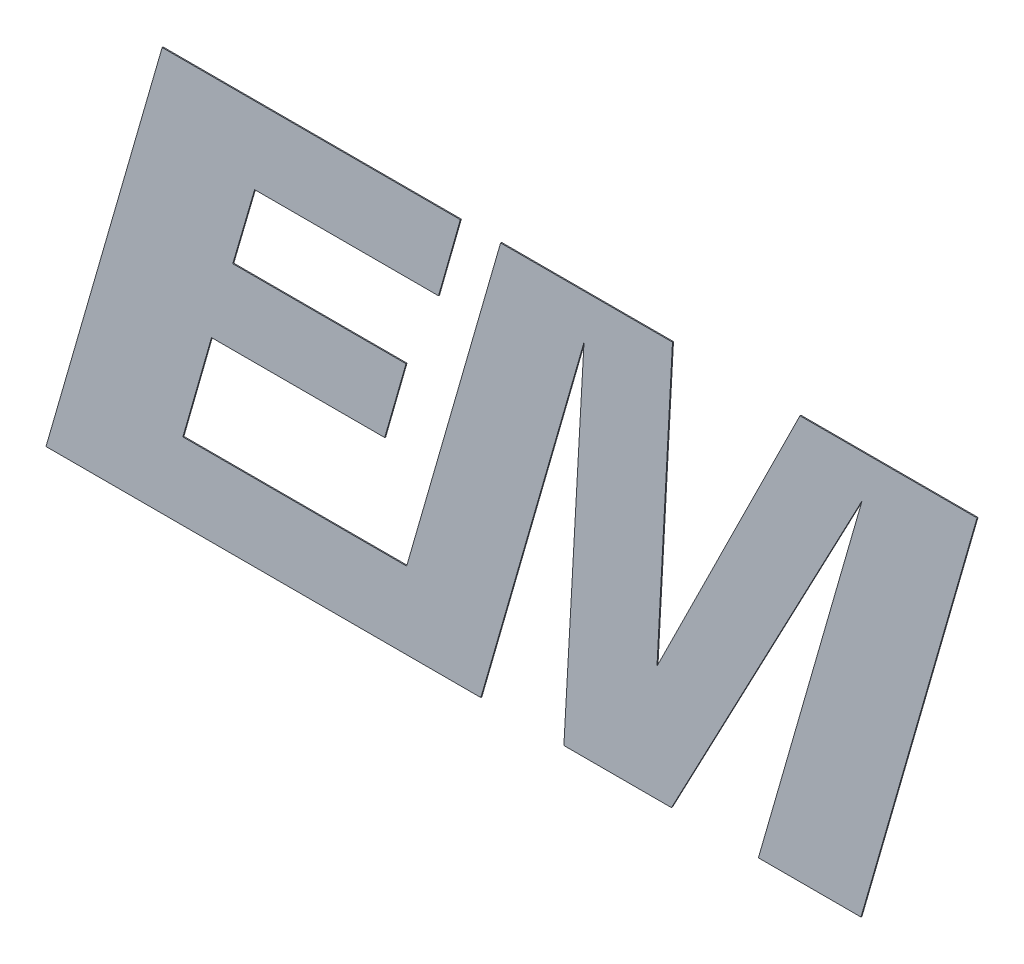
ISO-10303-21;
HEADER;
FILE_DESCRIPTION(('STEP AP214'),'2;1');
FILE_NAME('part.step','',(''),(''),'','','');
FILE_SCHEMA(('AUTOMOTIVE_DESIGN { 1 0 10303 214 1 1 1 1 }'));
ENDSEC;
DATA;
#1=APPLICATION_CONTEXT('core data for automotive mechanical design processes');
#2=APPLICATION_PROTOCOL_DEFINITION('international standard','automotive_design',2000,#1);
#3=PRODUCT_CONTEXT('',#1,'mechanical');
#4=PRODUCT('Part','Part','',(#3));
#5=PRODUCT_RELATED_PRODUCT_CATEGORY('part','',(#4));
#6=PRODUCT_DEFINITION_FORMATION('','',#4);
#7=PRODUCT_DEFINITION_CONTEXT('part definition',#1,'design');
#8=PRODUCT_DEFINITION('design','',#6,#7);
#9=PRODUCT_DEFINITION_SHAPE('','',#8);
#10=(LENGTH_UNIT() NAMED_UNIT(*) SI_UNIT(.MILLI.,.METRE.));
#11=(NAMED_UNIT(*) PLANE_ANGLE_UNIT() SI_UNIT($,.RADIAN.));
#12=(NAMED_UNIT(*) SI_UNIT($,.STERADIAN.) SOLID_ANGLE_UNIT());
#13=UNCERTAINTY_MEASURE_WITH_UNIT(LENGTH_MEASURE(1.E-05),#10,'distance_accuracy_value','');
#14=(GEOMETRIC_REPRESENTATION_CONTEXT(3) GLOBAL_UNCERTAINTY_ASSIGNED_CONTEXT((#13)) GLOBAL_UNIT_ASSIGNED_CONTEXT((#10,
#11,#12)) REPRESENTATION_CONTEXT('',''));
#15=CARTESIAN_POINT('',(0.,0.,0.));
#16=DIRECTION('',(0.,0.,1.));
#17=DIRECTION('',(1.,0.,0.));
#18=AXIS2_PLACEMENT_3D('',#15,#16,#17);
#19=CARTESIAN_POINT('',(10.8469375416372,6.82608440985244,5.205));
#20=DIRECTION('',(0.,-1.,0.));
#21=DIRECTION('',(0.,0.,-1.));
#22=AXIS2_PLACEMENT_3D('',#19,#20,#21);
#23=PLANE('',#22);
#24=DIRECTION('',(-1.,0.,0.));
#25=VECTOR('',#24,1.);
#26=CARTESIAN_POINT('',(10.8469375416372,6.82608440985244,5.2));
#27=LINE('',#26,#25);
#28=CARTESIAN_POINT('',(10.8469375416372,6.82608440985244,5.2));
#29=VERTEX_POINT('',#28);
#30=CARTESIAN_POINT('',(9.94792919842269,6.82608440985244,5.2));
#31=VERTEX_POINT('',#30);
#32=EDGE_CURVE('E11',#29,#31,#27,.T.);
#33=ORIENTED_EDGE('',*,*,#32,.T.);
#34=DIRECTION('',(0.,0.,-1.));
#35=VECTOR('',#34,1.);
#36=CARTESIAN_POINT('',(9.94792919842269,6.82608440985244,5.205));
#37=LINE('',#36,#35);
#38=CARTESIAN_POINT('',(9.94792919842269,6.82608440985244,5.205));
#39=VERTEX_POINT('',#38);
#40=EDGE_CURVE('E43',#39,#31,#37,.T.);
#41=ORIENTED_EDGE('',*,*,#40,.F.);
#42=DIRECTION('',(-1.,0.,0.));
#43=VECTOR('',#42,1.);
#44=CARTESIAN_POINT('',(10.8469375416372,6.82608440985244,5.205));
#45=LINE('',#44,#43);
#46=CARTESIAN_POINT('',(10.8469375416372,6.82608440985244,5.205));
#47=VERTEX_POINT('',#46);
#48=EDGE_CURVE('E415',#47,#39,#45,.T.);
#49=ORIENTED_EDGE('',*,*,#48,.F.);
#50=DIRECTION('',(0.,0.,-1.));
#51=VECTOR('',#50,1.);
#52=CARTESIAN_POINT('',(10.8469375416372,6.82608440985244,5.205));
#53=LINE('',#52,#51);
#54=EDGE_CURVE('E28',#47,#29,#53,.T.);
#55=ORIENTED_EDGE('',*,*,#54,.T.);
#56=EDGE_LOOP('',(#33,#41,#49,#55));
#57=FACE_BOUND('',#56,.T.);
#58=ADVANCED_FACE('F17',(#57),#23,.F.);
#59=CARTESIAN_POINT('',(9.94792919842269,6.82608440985244,5.205));
#60=DIRECTION('',(0.89586763618268,-0.444321030832952,0.));
#61=DIRECTION('',(0.,0.,-1.));
#62=AXIS2_PLACEMENT_3D('',#59,#60,#61);
#63=PLANE('',#62);
#64=DIRECTION('',(-0.444321030832952,-0.89586763618268,0.));
#65=VECTOR('',#64,1.);
#66=CARTESIAN_POINT('',(9.94792919842269,6.82608440985244,5.2));
#67=LINE('',#66,#65);
#68=CARTESIAN_POINT('',(9.22164915934347,5.36171352334091,5.2));
#69=VERTEX_POINT('',#68);
#70=EDGE_CURVE('E303',#31,#69,#67,.T.);
#71=ORIENTED_EDGE('',*,*,#70,.T.);
#72=DIRECTION('',(0.,0.,-1.));
#73=VECTOR('',#72,1.);
#74=CARTESIAN_POINT('',(9.22164915934347,5.36171352334091,5.205));
#75=LINE('',#74,#73);
#76=CARTESIAN_POINT('',(9.22164915934347,5.36171352334091,5.205));
#77=VERTEX_POINT('',#76);
#78=EDGE_CURVE('E365',#77,#69,#75,.T.);
#79=ORIENTED_EDGE('',*,*,#78,.F.);
#80=DIRECTION('',(-0.444321030832952,-0.89586763618268,0.));
#81=VECTOR('',#80,1.);
#82=CARTESIAN_POINT('',(9.94792919842269,6.82608440985244,5.205));
#83=LINE('',#82,#81);
#84=EDGE_CURVE('E372',#39,#77,#83,.T.);
#85=ORIENTED_EDGE('',*,*,#84,.F.);
#86=ORIENTED_EDGE('',*,*,#40,.T.);
#87=EDGE_LOOP('',(#71,#79,#85,#86));
#88=FACE_BOUND('',#87,.T.);
#89=ADVANCED_FACE('F510',(#88),#63,.F.);
#90=CARTESIAN_POINT('',(9.22164915934347,5.36171352334091,5.205));
#91=DIRECTION('',(-0.998554284376095,0.0537525920690858,0.));
#92=DIRECTION('',(0.,0.,1.));
#93=AXIS2_PLACEMENT_3D('',#90,#91,#92);
#94=PLANE('',#93);
#95=DIRECTION('',(0.0537525920690858,0.998554284376095,0.));
#96=VECTOR('',#95,1.);
#97=CARTESIAN_POINT('',(9.22164915934347,5.36171352334091,5.2));
#98=LINE('',#97,#96);
#99=CARTESIAN_POINT('',(9.30047685267181,6.82608440985244,5.2));
#100=VERTEX_POINT('',#99);
#101=EDGE_CURVE('E347',#69,#100,#98,.T.);
#102=ORIENTED_EDGE('',*,*,#101,.T.);
#103=DIRECTION('',(0.,0.,-1.));
#104=VECTOR('',#103,1.);
#105=CARTESIAN_POINT('',(9.30047685267181,6.82608440985244,5.205));
#106=LINE('',#105,#104);
#107=CARTESIAN_POINT('',(9.30047685267181,6.82608440985244,5.205));
#108=VERTEX_POINT('',#107);
#109=EDGE_CURVE('E153',#108,#100,#106,.T.);
#110=ORIENTED_EDGE('',*,*,#109,.F.);
#111=DIRECTION('',(0.0537525920690858,0.998554284376095,0.));
#112=VECTOR('',#111,1.);
#113=CARTESIAN_POINT('',(9.22164915934347,5.36171352334091,5.205));
#114=LINE('',#113,#112);
#115=EDGE_CURVE('E164',#77,#108,#114,.T.);
#116=ORIENTED_EDGE('',*,*,#115,.F.);
#117=ORIENTED_EDGE('',*,*,#78,.T.);
#118=EDGE_LOOP('',(#102,#110,#116,#117));
#119=FACE_BOUND('',#118,.T.);
#120=ADVANCED_FACE('F513',(#119),#94,.F.);
#121=CARTESIAN_POINT('',(9.30047685267181,6.82608440985244,5.205));
#122=DIRECTION('',(0.,-1.,0.));
#123=DIRECTION('',(0.,0.,-1.));
#124=AXIS2_PLACEMENT_3D('',#121,#122,#123);
#125=PLANE('',#124);
#126=DIRECTION('',(-1.,0.,0.));
#127=VECTOR('',#126,1.);
#128=CARTESIAN_POINT('',(9.30047685267181,6.82608440985244,5.2));
#129=LINE('',#128,#127);
#130=CARTESIAN_POINT('',(8.42755896722305,6.82608440985244,5.2));
#131=VERTEX_POINT('',#130);
#132=EDGE_CURVE('E398',#100,#131,#129,.T.);
#133=ORIENTED_EDGE('',*,*,#132,.T.);
#134=DIRECTION('',(0.,0.,-1.));
#135=VECTOR('',#134,1.);
#136=CARTESIAN_POINT('',(8.42755896722305,6.82608440985244,5.205));
#137=LINE('',#136,#135);
#138=CARTESIAN_POINT('',(8.42755896722305,6.82608440985244,5.205));
#139=VERTEX_POINT('',#138);
#140=EDGE_CURVE('E271',#139,#131,#137,.T.);
#141=ORIENTED_EDGE('',*,*,#140,.F.);
#142=DIRECTION('',(-1.,0.,0.));
#143=VECTOR('',#142,1.);
#144=CARTESIAN_POINT('',(9.30047685267181,6.82608440985244,5.205));
#145=LINE('',#144,#143);
#146=EDGE_CURVE('E286',#108,#139,#145,.T.);
#147=ORIENTED_EDGE('',*,*,#146,.F.);
#148=ORIENTED_EDGE('',*,*,#109,.T.);
#149=EDGE_LOOP('',(#133,#141,#147,#148));
#150=FACE_BOUND('',#149,.T.);
#151=ADVANCED_FACE('F518',(#150),#125,.F.);
#152=CARTESIAN_POINT('',(8.42755896722305,6.82608440985244,5.205));
#153=DIRECTION('',(0.961085306551383,-0.276251757516641,0.));
#154=DIRECTION('',(0.,0.,-1.));
#155=AXIS2_PLACEMENT_3D('',#152,#153,#154);
#156=PLANE('',#155);
#157=DIRECTION('',(-0.276251757516641,-0.961085306551383,0.));
#158=VECTOR('',#157,1.);
#159=CARTESIAN_POINT('',(8.42755896722305,6.82608440985244,5.2));
#160=LINE('',#159,#158);
#161=CARTESIAN_POINT('',(7.95047417520321,5.16629701985992,5.2));
#162=VERTEX_POINT('',#161);
#163=EDGE_CURVE('E348',#131,#162,#160,.T.);
#164=ORIENTED_EDGE('',*,*,#163,.T.);
#165=DIRECTION('',(0.,0.,-1.));
#166=VECTOR('',#165,1.);
#167=CARTESIAN_POINT('',(7.95047417520321,5.16629701985992,5.205));
#168=LINE('',#167,#166);
#169=CARTESIAN_POINT('',(7.95047417520321,5.16629701985992,5.205));
#170=VERTEX_POINT('',#169);
#171=EDGE_CURVE('E266',#170,#162,#168,.T.);
#172=ORIENTED_EDGE('',*,*,#171,.F.);
#173=DIRECTION('',(-0.276251757516641,-0.961085306551383,0.));
#174=VECTOR('',#173,1.);
#175=CARTESIAN_POINT('',(8.42755896722305,6.82608440985244,5.205));
#176=LINE('',#175,#174);
#177=EDGE_CURVE('E373',#139,#170,#176,.T.);
#178=ORIENTED_EDGE('',*,*,#177,.F.);
#179=ORIENTED_EDGE('',*,*,#140,.T.);
#180=EDGE_LOOP('',(#164,#172,#178,#179));
#181=FACE_BOUND('',#180,.T.);
#182=ADVANCED_FACE('F555',(#181),#156,.F.);
#183=CARTESIAN_POINT('',(7.95047417520321,5.16629701985992,5.205));
#184=DIRECTION('',(0.,-1.,0.));
#185=DIRECTION('',(0.,0.,-1.));
#186=AXIS2_PLACEMENT_3D('',#183,#184,#185);
#187=PLANE('',#186);
#188=DIRECTION('',(-1.,0.,0.));
#189=VECTOR('',#188,1.);
#190=CARTESIAN_POINT('',(7.95047417520321,5.16629701985992,5.2));
#191=LINE('',#190,#189);
#192=CARTESIAN_POINT('',(6.8142036420702,5.16629701985992,5.2));
#193=VERTEX_POINT('',#192);
#194=EDGE_CURVE('E263',#162,#193,#191,.T.);
#195=ORIENTED_EDGE('',*,*,#194,.T.);
#196=DIRECTION('',(0.,0.,-1.));
#197=VECTOR('',#196,1.);
#198=CARTESIAN_POINT('',(6.8142036420702,5.16629701985992,5.205));
#199=LINE('',#198,#197);
#200=CARTESIAN_POINT('',(6.8142036420702,5.16629701985992,5.205));
#201=VERTEX_POINT('',#200);
#202=EDGE_CURVE('E249',#201,#193,#199,.T.);
#203=ORIENTED_EDGE('',*,*,#202,.F.);
#204=DIRECTION('',(-1.,0.,0.));
#205=VECTOR('',#204,1.);
#206=CARTESIAN_POINT('',(7.95047417520321,5.16629701985992,5.205));
#207=LINE('',#206,#205);
#208=EDGE_CURVE('E340',#170,#201,#207,.T.);
#209=ORIENTED_EDGE('',*,*,#208,.F.);
#210=ORIENTED_EDGE('',*,*,#171,.T.);
#211=EDGE_LOOP('',(#195,#203,#209,#210));
#212=FACE_BOUND('',#211,.T.);
#213=ADVANCED_FACE('F264',(#212),#187,.F.);
#214=CARTESIAN_POINT('',(6.8142036420702,5.16629701985992,5.205));
#215=DIRECTION('',(-0.96172348726206,0.274021776595407,0.));
#216=DIRECTION('',(0.,0.,1.));
#217=AXIS2_PLACEMENT_3D('',#214,#215,#216);
#218=PLANE('',#217);
#219=DIRECTION('',(0.274021776595406,0.96172348726206,0.));
#220=VECTOR('',#219,1.);
#221=CARTESIAN_POINT('',(6.8142036420702,5.16629701985992,5.2));
#222=LINE('',#221,#220);
#223=CARTESIAN_POINT('',(6.9593583790476,5.6757409099513,5.2));
#224=VERTEX_POINT('',#223);
#225=EDGE_CURVE('E254',#193,#224,#222,.T.);
#226=ORIENTED_EDGE('',*,*,#225,.T.);
#227=DIRECTION('',(0.,0.,-1.));
#228=VECTOR('',#227,1.);
#229=CARTESIAN_POINT('',(6.9593583790476,5.6757409099513,5.205));
#230=LINE('',#229,#228);
#231=CARTESIAN_POINT('',(6.9593583790476,5.6757409099513,5.205));
#232=VERTEX_POINT('',#231);
#233=EDGE_CURVE('E351',#232,#224,#230,.T.);
#234=ORIENTED_EDGE('',*,*,#233,.F.);
#235=DIRECTION('',(0.274021776595406,0.96172348726206,0.));
#236=VECTOR('',#235,1.);
#237=CARTESIAN_POINT('',(6.8142036420702,5.16629701985992,5.205));
#238=LINE('',#237,#236);
#239=EDGE_CURVE('E256',#201,#232,#238,.T.);
#240=ORIENTED_EDGE('',*,*,#239,.F.);
#241=ORIENTED_EDGE('',*,*,#202,.T.);
#242=EDGE_LOOP('',(#226,#234,#240,#241));
#243=FACE_BOUND('',#242,.T.);
#244=ADVANCED_FACE('F251',(#243),#218,.F.);
#245=CARTESIAN_POINT('',(6.9593583790476,5.6757409099513,5.205));
#246=DIRECTION('',(0.,1.,0.));
#247=DIRECTION('',(1.,0.,0.));
#248=AXIS2_PLACEMENT_3D('',#245,#246,#247);
#249=PLANE('',#248);
#250=DIRECTION('',(1.,0.,0.));
#251=VECTOR('',#250,1.);
#252=CARTESIAN_POINT('',(6.9593583790476,5.6757409099513,5.2));
#253=LINE('',#252,#251);
#254=CARTESIAN_POINT('',(7.83901228958873,5.6757409099513,5.2));
#255=VERTEX_POINT('',#254);
#256=EDGE_CURVE('E260',#224,#255,#253,.T.);
#257=ORIENTED_EDGE('',*,*,#256,.T.);
#258=DIRECTION('',(0.,0.,-1.));
#259=VECTOR('',#258,1.);
#260=CARTESIAN_POINT('',(7.83901228958873,5.6757409099513,5.205));
#261=LINE('',#260,#259);
#262=CARTESIAN_POINT('',(7.83901228958873,5.6757409099513,5.205));
#263=VERTEX_POINT('',#262);
#264=EDGE_CURVE('E387',#263,#255,#261,.T.);
#265=ORIENTED_EDGE('',*,*,#264,.F.);
#266=DIRECTION('',(1.,0.,0.));
#267=VECTOR('',#266,1.);
#268=CARTESIAN_POINT('',(6.9593583790476,5.6757409099513,5.205));
#269=LINE('',#268,#267);
#270=EDGE_CURVE('E341',#232,#263,#269,.T.);
#271=ORIENTED_EDGE('',*,*,#270,.F.);
#272=ORIENTED_EDGE('',*,*,#233,.T.);
#273=EDGE_LOOP('',(#257,#265,#271,#272));
#274=FACE_BOUND('',#273,.T.);
#275=ADVANCED_FACE('F630',(#274),#249,.F.);
#276=CARTESIAN_POINT('',(7.83901228958873,5.6757409099513,5.205));
#277=DIRECTION('',(-0.961545429433448,0.27464593049169,0.));
#278=DIRECTION('',(0.,0.,1.));
#279=AXIS2_PLACEMENT_3D('',#276,#277,#278);
#280=PLANE('',#279);
#281=DIRECTION('',(0.27464593049169,0.961545429433448,0.));
#282=VECTOR('',#281,1.);
#283=CARTESIAN_POINT('',(7.83901228958873,5.6757409099513,5.2));
#284=LINE('',#283,#282);
#285=CARTESIAN_POINT('',(7.94724574439114,6.05467018660481,5.2));
#286=VERTEX_POINT('',#285);
#287=EDGE_CURVE('E354',#255,#286,#284,.T.);
#288=ORIENTED_EDGE('',*,*,#287,.T.);
#289=DIRECTION('',(0.,0.,-1.));
#290=VECTOR('',#289,1.);
#291=CARTESIAN_POINT('',(7.94724574439114,6.05467018660481,5.205));
#292=LINE('',#291,#290);
#293=CARTESIAN_POINT('',(7.94724574439114,6.05467018660481,5.205));
#294=VERTEX_POINT('',#293);
#295=EDGE_CURVE('E293',#294,#286,#292,.T.);
#296=ORIENTED_EDGE('',*,*,#295,.F.);
#297=DIRECTION('',(0.27464593049169,0.961545429433448,0.));
#298=VECTOR('',#297,1.);
#299=CARTESIAN_POINT('',(7.83901228958873,5.6757409099513,5.205));
#300=LINE('',#299,#298);
#301=EDGE_CURVE('E357',#263,#294,#300,.T.);
#302=ORIENTED_EDGE('',*,*,#301,.F.);
#303=ORIENTED_EDGE('',*,*,#264,.T.);
#304=EDGE_LOOP('',(#288,#296,#302,#303));
#305=FACE_BOUND('',#304,.T.);
#306=ADVANCED_FACE('F621',(#305),#280,.F.);
#307=CARTESIAN_POINT('',(7.94724574439114,6.05467018660481,5.205));
#308=DIRECTION('',(0.,-1.,0.));
#309=DIRECTION('',(0.,0.,-1.));
#310=AXIS2_PLACEMENT_3D('',#307,#308,#309);
#311=PLANE('',#310);
#312=DIRECTION('',(-1.,0.,0.));
#313=VECTOR('',#312,1.);
#314=CARTESIAN_POINT('',(7.94724574439114,6.05467018660481,5.2));
#315=LINE('',#314,#313);
#316=CARTESIAN_POINT('',(7.06746718401157,6.05467018660481,5.2));
#317=VERTEX_POINT('',#316);
#318=EDGE_CURVE('E296',#286,#317,#315,.T.);
#319=ORIENTED_EDGE('',*,*,#318,.T.);
#320=DIRECTION('',(0.,0.,-1.));
#321=VECTOR('',#320,1.);
#322=CARTESIAN_POINT('',(7.06746718401157,6.05467018660481,5.205));
#323=LINE('',#322,#321);
#324=CARTESIAN_POINT('',(7.06746718401157,6.05467018660481,5.205));
#325=VERTEX_POINT('',#324);
#326=EDGE_CURVE('E383',#325,#317,#323,.T.);
#327=ORIENTED_EDGE('',*,*,#326,.F.);
#328=DIRECTION('',(-1.,0.,0.));
#329=VECTOR('',#328,1.);
#330=CARTESIAN_POINT('',(7.94724574439114,6.05467018660481,5.205));
#331=LINE('',#330,#329);
#332=EDGE_CURVE('E360',#294,#325,#331,.T.);
#333=ORIENTED_EDGE('',*,*,#332,.F.);
#334=ORIENTED_EDGE('',*,*,#295,.T.);
#335=EDGE_LOOP('',(#319,#327,#333,#334));
#336=FACE_BOUND('',#335,.T.);
#337=ADVANCED_FACE('F591',(#336),#311,.F.);
#338=CARTESIAN_POINT('',(7.06746718401157,6.05467018660481,5.205));
#339=DIRECTION('',(-0.960176311432759,0.27939479408783,0.));
#340=DIRECTION('',(0.,0.,1.));
#341=AXIS2_PLACEMENT_3D('',#338,#339,#340);
#342=PLANE('',#341);
#343=DIRECTION('',(0.27939479408783,0.960176311432759,0.));
#344=VECTOR('',#343,1.);
#345=CARTESIAN_POINT('',(7.06746718401157,6.05467018660481,5.2));
#346=LINE('',#345,#344);
#347=CARTESIAN_POINT('',(7.17840554031016,6.43592418274659,5.2));
#348=VERTEX_POINT('',#347);
#349=EDGE_CURVE('E297',#317,#348,#346,.T.);
#350=ORIENTED_EDGE('',*,*,#349,.T.);
#351=DIRECTION('',(0.,0.,-1.));
#352=VECTOR('',#351,1.);
#353=CARTESIAN_POINT('',(7.17840554031016,6.43592418274659,5.205));
#354=LINE('',#353,#352);
#355=CARTESIAN_POINT('',(7.17840554031016,6.43592418274659,5.205));
#356=VERTEX_POINT('',#355);
#357=EDGE_CURVE('E298',#356,#348,#354,.T.);
#358=ORIENTED_EDGE('',*,*,#357,.F.);
#359=DIRECTION('',(0.27939479408783,0.960176311432759,0.));
#360=VECTOR('',#359,1.);
#361=CARTESIAN_POINT('',(7.06746718401157,6.05467018660481,5.205));
#362=LINE('',#361,#360);
#363=EDGE_CURVE('E394',#325,#356,#362,.T.);
#364=ORIENTED_EDGE('',*,*,#363,.F.);
#365=ORIENTED_EDGE('',*,*,#326,.T.);
#366=EDGE_LOOP('',(#350,#358,#364,#365));
#367=FACE_BOUND('',#366,.T.);
#368=ADVANCED_FACE('F587',(#367),#342,.F.);
#369=CARTESIAN_POINT('',(7.17840554031016,6.43592418274659,5.205));
#370=DIRECTION('',(0.,1.,0.));
#371=DIRECTION('',(1.,0.,0.));
#372=AXIS2_PLACEMENT_3D('',#369,#370,#371);
#373=PLANE('',#372);
#374=DIRECTION('',(1.,0.,0.));
#375=VECTOR('',#374,1.);
#376=CARTESIAN_POINT('',(7.17840554031016,6.43592418274659,5.2));
#377=LINE('',#376,#375);
#378=CARTESIAN_POINT('',(8.11229459559777,6.43592418274659,5.2));
#379=VERTEX_POINT('',#378);
#380=EDGE_CURVE('E301',#348,#379,#377,.T.);
#381=ORIENTED_EDGE('',*,*,#380,.T.);
#382=DIRECTION('',(0.,0.,-1.));
#383=VECTOR('',#382,1.);
#384=CARTESIAN_POINT('',(8.11229459559777,6.43592418274659,5.205));
#385=LINE('',#384,#383);
#386=CARTESIAN_POINT('',(8.11229459559777,6.43592418274659,5.205));
#387=VERTEX_POINT('',#386);
#388=EDGE_CURVE('E379',#387,#379,#385,.T.);
#389=ORIENTED_EDGE('',*,*,#388,.F.);
#390=DIRECTION('',(1.,0.,0.));
#391=VECTOR('',#390,1.);
#392=CARTESIAN_POINT('',(7.17840554031016,6.43592418274659,5.205));
#393=LINE('',#392,#391);
#394=EDGE_CURVE('E391',#356,#387,#393,.T.);
#395=ORIENTED_EDGE('',*,*,#394,.F.);
#396=ORIENTED_EDGE('',*,*,#357,.T.);
#397=EDGE_LOOP('',(#381,#389,#395,#396));
#398=FACE_BOUND('',#397,.T.);
#399=ADVANCED_FACE('F565',(#398),#373,.F.);
#400=CARTESIAN_POINT('',(8.11229459559777,6.43592418274659,5.205));
#401=DIRECTION('',(-0.961953028041548,0.273214882174628,0.));
#402=DIRECTION('',(0.,0.,1.));
#403=AXIS2_PLACEMENT_3D('',#400,#401,#402);
#404=PLANE('',#403);
#405=DIRECTION('',(0.273214882174629,0.961953028041548,0.));
#406=VECTOR('',#405,1.);
#407=CARTESIAN_POINT('',(8.11229459559777,6.43592418274659,5.2));
#408=LINE('',#407,#406);
#409=CARTESIAN_POINT('',(8.22310830205803,6.82608440985244,5.2));
#410=VERTEX_POINT('',#409);
#411=EDGE_CURVE('E302',#379,#410,#408,.T.);
#412=ORIENTED_EDGE('',*,*,#411,.T.);
#413=DIRECTION('',(0.,0.,-1.));
#414=VECTOR('',#413,1.);
#415=CARTESIAN_POINT('',(8.22310830205803,6.82608440985244,5.205));
#416=LINE('',#415,#414);
#417=CARTESIAN_POINT('',(8.22310830205803,6.82608440985244,5.205));
#418=VERTEX_POINT('',#417);
#419=EDGE_CURVE('E366',#418,#410,#416,.T.);
#420=ORIENTED_EDGE('',*,*,#419,.F.);
#421=DIRECTION('',(0.273214882174629,0.961953028041548,0.));
#422=VECTOR('',#421,1.);
#423=CARTESIAN_POINT('',(8.11229459559777,6.43592418274659,5.205));
#424=LINE('',#423,#422);
#425=EDGE_CURVE('E395',#387,#418,#424,.T.);
#426=ORIENTED_EDGE('',*,*,#425,.F.);
#427=ORIENTED_EDGE('',*,*,#388,.T.);
#428=EDGE_LOOP('',(#412,#420,#426,#427));
#429=FACE_BOUND('',#428,.T.);
#430=ADVANCED_FACE('F560',(#429),#404,.F.);
#431=CARTESIAN_POINT('',(8.22310830205803,6.82608440985244,5.205));
#432=DIRECTION('',(0.,-1.,0.));
#433=DIRECTION('',(0.,0.,-1.));
#434=AXIS2_PLACEMENT_3D('',#431,#432,#433);
#435=PLANE('',#434);
#436=DIRECTION('',(-1.,0.,0.));
#437=VECTOR('',#436,1.);
#438=CARTESIAN_POINT('',(8.22310830205803,6.82608440985244,5.2));
#439=LINE('',#438,#437);
#440=CARTESIAN_POINT('',(6.70881843609201,6.82608440985244,5.2));
#441=VERTEX_POINT('',#440);
#442=EDGE_CURVE('E368',#410,#441,#439,.T.);
#443=ORIENTED_EDGE('',*,*,#442,.T.);
#444=DIRECTION('',(0.,0.,-1.));
#445=VECTOR('',#444,1.);
#446=CARTESIAN_POINT('',(6.70881843609201,6.82608440985244,5.205));
#447=LINE('',#446,#445);
#448=CARTESIAN_POINT('',(6.70881843609201,6.82608440985244,5.205));
#449=VERTEX_POINT('',#448);
#450=EDGE_CURVE('E230',#449,#441,#447,.T.);
#451=ORIENTED_EDGE('',*,*,#450,.F.);
#452=DIRECTION('',(-1.,0.,0.));
#453=VECTOR('',#452,1.);
#454=CARTESIAN_POINT('',(8.22310830205803,6.82608440985244,5.205));
#455=LINE('',#454,#453);
#456=EDGE_CURVE('E238',#418,#449,#455,.T.);
#457=ORIENTED_EDGE('',*,*,#456,.F.);
#458=ORIENTED_EDGE('',*,*,#419,.T.);
#459=EDGE_LOOP('',(#443,#451,#457,#458));
#460=FACE_BOUND('',#459,.T.);
#461=ADVANCED_FACE('F564',(#460),#435,.F.);
#462=CARTESIAN_POINT('',(6.70881843609201,6.82608440985244,5.205));
#463=DIRECTION('',(0.961002990822128,-0.276537975024996,0.));
#464=DIRECTION('',(0.,0.,-1.));
#465=AXIS2_PLACEMENT_3D('',#462,#463,#464);
#466=PLANE('',#465);
#467=DIRECTION('',(-0.276537975024996,-0.961002990822128,0.));
#468=VECTOR('',#467,1.);
#469=CARTESIAN_POINT('',(6.70881843609201,6.82608440985244,5.2));
#470=LINE('',#469,#468);
#471=CARTESIAN_POINT('',(6.11898163099086,4.77632999999994,5.2));
#472=VERTEX_POINT('',#471);
#473=EDGE_CURVE('E337',#441,#472,#470,.T.);
#474=ORIENTED_EDGE('',*,*,#473,.T.);
#475=DIRECTION('',(0.,0.,-1.));
#476=VECTOR('',#475,1.);
#477=CARTESIAN_POINT('',(6.11898163099086,4.77632999999994,5.205));
#478=LINE('',#477,#476);
#479=CARTESIAN_POINT('',(6.11898163099086,4.77632999999994,5.205));
#480=VERTEX_POINT('',#479);
#481=EDGE_CURVE('E403',#480,#472,#478,.T.);
#482=ORIENTED_EDGE('',*,*,#481,.F.);
#483=DIRECTION('',(-0.276537975024996,-0.961002990822128,0.));
#484=VECTOR('',#483,1.);
#485=CARTESIAN_POINT('',(6.70881843609201,6.82608440985244,5.205));
#486=LINE('',#485,#484);
#487=EDGE_CURVE('E420',#449,#480,#486,.T.);
#488=ORIENTED_EDGE('',*,*,#487,.F.);
#489=ORIENTED_EDGE('',*,*,#450,.T.);
#490=EDGE_LOOP('',(#474,#482,#488,#489));
#491=FACE_BOUND('',#490,.T.);
#492=ADVANCED_FACE('F454',(#491),#466,.F.);
#493=CARTESIAN_POINT('',(7.96234707068914,4.77632999999994,5.205));
#494=DIRECTION('',(0.,1.,0.));
#495=DIRECTION('',(1.,0.,0.));
#496=AXIS2_PLACEMENT_3D('',#493,#494,#495);
#497=PLANE('',#496);
#498=DIRECTION('',(1.,0.,0.));
#499=VECTOR('',#498,1.);
#500=CARTESIAN_POINT('',(7.96234707068914,4.77632999999994,5.2));
#501=LINE('',#500,#499);
#502=CARTESIAN_POINT('',(8.32719714808094,4.77632999999994,5.2));
#503=VERTEX_POINT('',#502);
#504=EDGE_CURVE('E406',#472,#503,#501,.T.);
#505=ORIENTED_EDGE('',*,*,#504,.T.);
#506=DIRECTION('',(0.,0.,-1.));
#507=VECTOR('',#506,1.);
#508=CARTESIAN_POINT('',(8.32719714808094,4.77632999999994,5.205));
#509=LINE('',#508,#507);
#510=CARTESIAN_POINT('',(8.32719714808094,4.77632999999994,5.205));
#511=VERTEX_POINT('',#510);
#512=EDGE_CURVE('E459',#511,#503,#509,.T.);
#513=ORIENTED_EDGE('',*,*,#512,.F.);
#514=DIRECTION('',(1.,0.,0.));
#515=VECTOR('',#514,1.);
#516=CARTESIAN_POINT('',(6.11898163099086,4.77632999999994,5.205));
#517=LINE('',#516,#515);
#518=EDGE_CURVE('E321',#480,#511,#517,.T.);
#519=ORIENTED_EDGE('',*,*,#518,.F.);
#520=ORIENTED_EDGE('',*,*,#481,.T.);
#521=EDGE_LOOP('',(#505,#513,#519,#520));
#522=FACE_BOUND('',#521,.T.);
#523=ADVANCED_FACE('F458',(#522),#497,.F.);
#524=CARTESIAN_POINT('',(8.32719714808094,4.77632999999994,5.205));
#525=DIRECTION('',(-0.961163884540897,0.27597823655907,0.));
#526=DIRECTION('',(0.,0.,1.));
#527=AXIS2_PLACEMENT_3D('',#524,#525,#526);
#528=PLANE('',#527);
#529=DIRECTION('',(0.27597823655907,0.961163884540897,0.));
#530=VECTOR('',#529,1.);
#531=CARTESIAN_POINT('',(8.32719714808094,4.77632999999994,5.2));
#532=LINE('',#531,#530);
#533=CARTESIAN_POINT('',(8.85116274436316,6.60117247369481,5.2));
#534=VERTEX_POINT('',#533);
#535=EDGE_CURVE('E407',#503,#534,#532,.T.);
#536=ORIENTED_EDGE('',*,*,#535,.T.);
#537=DIRECTION('',(0.,0.,-1.));
#538=VECTOR('',#537,1.);
#539=CARTESIAN_POINT('',(8.85116274436316,6.60117247369481,5.205));
#540=LINE('',#539,#538);
#541=CARTESIAN_POINT('',(8.85116274436316,6.60117247369481,5.205));
#542=VERTEX_POINT('',#541);
#543=EDGE_CURVE('E469',#542,#534,#540,.T.);
#544=ORIENTED_EDGE('',*,*,#543,.F.);
#545=DIRECTION('',(0.27597823655907,0.961163884540897,0.));
#546=VECTOR('',#545,1.);
#547=CARTESIAN_POINT('',(8.32719714808094,4.77632999999994,5.205));
#548=LINE('',#547,#546);
#549=EDGE_CURVE('E313',#511,#542,#548,.T.);
#550=ORIENTED_EDGE('',*,*,#549,.F.);
#551=ORIENTED_EDGE('',*,*,#512,.T.);
#552=EDGE_LOOP('',(#536,#544,#550,#551));
#553=FACE_BOUND('',#552,.T.);
#554=ADVANCED_FACE('F468',(#553),#528,.F.);
#555=CARTESIAN_POINT('',(8.85116274436316,6.60117247369481,5.205));
#556=DIRECTION('',(0.998432730113024,-0.0559650197806937,0.));
#557=DIRECTION('',(0.,0.,-1.));
#558=AXIS2_PLACEMENT_3D('',#555,#556,#557);
#559=PLANE('',#558);
#560=DIRECTION('',(-0.0559650197806937,-0.998432730113024,0.));
#561=VECTOR('',#560,1.);
#562=CARTESIAN_POINT('',(8.85116274436316,6.60117247369481,5.2));
#563=LINE('',#562,#561);
#564=CARTESIAN_POINT('',(8.74887508686076,4.77632999999994,5.2));
#565=VERTEX_POINT('',#564);
#566=EDGE_CURVE('E465',#534,#565,#563,.T.);
#567=ORIENTED_EDGE('',*,*,#566,.T.);
#568=DIRECTION('',(0.,0.,-1.));
#569=VECTOR('',#568,1.);
#570=CARTESIAN_POINT('',(8.74887508686076,4.77632999999994,5.205));
#571=LINE('',#570,#569);
#572=CARTESIAN_POINT('',(8.74887508686076,4.77632999999994,5.205));
#573=VERTEX_POINT('',#572);
#574=EDGE_CURVE('E291',#573,#565,#571,.T.);
#575=ORIENTED_EDGE('',*,*,#574,.F.);
#576=DIRECTION('',(-0.0559650197806937,-0.998432730113024,0.));
#577=VECTOR('',#576,1.);
#578=CARTESIAN_POINT('',(8.85116274436316,6.60117247369481,5.205));
#579=LINE('',#578,#577);
#580=EDGE_CURVE('E311',#542,#573,#579,.T.);
#581=ORIENTED_EDGE('',*,*,#580,.F.);
#582=ORIENTED_EDGE('',*,*,#543,.T.);
#583=EDGE_LOOP('',(#567,#575,#581,#582));
#584=FACE_BOUND('',#583,.T.);
#585=ADVANCED_FACE('F475',(#584),#559,.F.);
#586=CARTESIAN_POINT('',(8.74887508686076,4.77632999999994,5.205));
#587=DIRECTION('',(0.,1.,0.));
#588=DIRECTION('',(1.,0.,0.));
#589=AXIS2_PLACEMENT_3D('',#586,#587,#588);
#590=PLANE('',#589);
#591=DIRECTION('',(1.,0.,0.));
#592=VECTOR('',#591,1.);
#593=CARTESIAN_POINT('',(8.74887508686076,4.77632999999994,5.2));
#594=LINE('',#593,#592);
#595=CARTESIAN_POINT('',(9.29532128152222,4.77632999999994,5.2));
#596=VERTEX_POINT('',#595);
#597=EDGE_CURVE('E423',#565,#596,#594,.T.);
#598=ORIENTED_EDGE('',*,*,#597,.T.);
#599=DIRECTION('',(0.,0.,-1.));
#600=VECTOR('',#599,1.);
#601=CARTESIAN_POINT('',(9.29532128152222,4.77632999999994,5.205));
#602=LINE('',#601,#600);
#603=CARTESIAN_POINT('',(9.29532128152222,4.77632999999994,5.205));
#604=VERTEX_POINT('',#603);
#605=EDGE_CURVE('E292',#604,#596,#602,.T.);
#606=ORIENTED_EDGE('',*,*,#605,.F.);
#607=DIRECTION('',(1.,0.,0.));
#608=VECTOR('',#607,1.);
#609=CARTESIAN_POINT('',(8.74887508686076,4.77632999999994,5.205));
#610=LINE('',#609,#608);
#611=EDGE_CURVE('E314',#573,#604,#610,.T.);
#612=ORIENTED_EDGE('',*,*,#611,.F.);
#613=ORIENTED_EDGE('',*,*,#574,.T.);
#614=EDGE_LOOP('',(#598,#606,#612,#613));
#615=FACE_BOUND('',#614,.T.);
#616=ADVANCED_FACE('F479',(#615),#590,.F.);
#617=CARTESIAN_POINT('',(9.29532128152222,4.77632999999994,5.205));
#618=DIRECTION('',(-0.884338666563768,0.466845930495508,0.));
#619=DIRECTION('',(0.,0.,1.));
#620=AXIS2_PLACEMENT_3D('',#617,#618,#619);
#621=PLANE('',#620);
#622=DIRECTION('',(0.466845930495508,0.884338666563768,0.));
#623=VECTOR('',#622,1.);
#624=CARTESIAN_POINT('',(9.29532128152222,4.77632999999994,5.2));
#625=LINE('',#624,#623);
#626=CARTESIAN_POINT('',(10.2633020676491,6.60996028730735,5.2));
#627=VERTEX_POINT('',#626);
#628=EDGE_CURVE('E288',#596,#627,#625,.T.);
#629=ORIENTED_EDGE('',*,*,#628,.T.);
#630=DIRECTION('',(0.,0.,-1.));
#631=VECTOR('',#630,1.);
#632=CARTESIAN_POINT('',(10.2633020676491,6.60996028730735,5.205));
#633=LINE('',#632,#631);
#634=CARTESIAN_POINT('',(10.2633020676491,6.60996028730735,5.205));
#635=VERTEX_POINT('',#634);
#636=EDGE_CURVE('E309',#635,#627,#633,.T.);
#637=ORIENTED_EDGE('',*,*,#636,.F.);
#638=DIRECTION('',(0.466845930495508,0.884338666563768,0.));
#639=VECTOR('',#638,1.);
#640=CARTESIAN_POINT('',(9.29532128152222,4.77632999999994,5.205));
#641=LINE('',#640,#639);
#642=EDGE_CURVE('E324',#604,#635,#641,.T.);
#643=ORIENTED_EDGE('',*,*,#642,.F.);
#644=ORIENTED_EDGE('',*,*,#605,.T.);
#645=EDGE_LOOP('',(#629,#637,#643,#644));
#646=FACE_BOUND('',#645,.T.);
#647=ADVANCED_FACE('F484',(#646),#621,.F.);
#648=CARTESIAN_POINT('',(10.2633020676491,6.60996028730735,5.205));
#649=DIRECTION('',(0.961154223343868,-0.276011881896858,0.));
#650=DIRECTION('',(0.,0.,-1.));
#651=AXIS2_PLACEMENT_3D('',#648,#649,#650);
#652=PLANE('',#651);
#653=DIRECTION('',(-0.276011881896858,-0.961154223343868,0.));
#654=VECTOR('',#653,1.);
#655=CARTESIAN_POINT('',(10.2633020676491,6.60996028730735,5.2));
#656=LINE('',#655,#654);
#657=CARTESIAN_POINT('',(9.73674375472605,4.77632999999994,5.2));
#658=VERTEX_POINT('',#657);
#659=EDGE_CURVE('E433',#627,#658,#656,.T.);
#660=ORIENTED_EDGE('',*,*,#659,.T.);
#661=DIRECTION('',(0.,0.,-1.));
#662=VECTOR('',#661,1.);
#663=CARTESIAN_POINT('',(9.73674375472605,4.77632999999994,5.205));
#664=LINE('',#663,#662);
#665=CARTESIAN_POINT('',(9.73674375472605,4.77632999999994,5.205));
#666=VERTEX_POINT('',#665);
#667=EDGE_CURVE('E310',#666,#658,#664,.T.);
#668=ORIENTED_EDGE('',*,*,#667,.F.);
#669=DIRECTION('',(-0.276011881896858,-0.961154223343868,0.));
#670=VECTOR('',#669,1.);
#671=CARTESIAN_POINT('',(10.2633020676491,6.60996028730735,5.205));
#672=LINE('',#671,#670);
#673=EDGE_CURVE('E333',#635,#666,#672,.T.);
#674=ORIENTED_EDGE('',*,*,#673,.F.);
#675=ORIENTED_EDGE('',*,*,#636,.T.);
#676=EDGE_LOOP('',(#660,#668,#674,#675));
#677=FACE_BOUND('',#676,.T.);
#678=ADVANCED_FACE('F491',(#677),#652,.F.);
#679=CARTESIAN_POINT('',(9.73674375472605,4.77632999999994,5.205));
#680=DIRECTION('',(0.,1.,0.));
#681=DIRECTION('',(1.,0.,0.));
#682=AXIS2_PLACEMENT_3D('',#679,#680,#681);
#683=PLANE('',#682);
#684=DIRECTION('',(1.,0.,0.));
#685=VECTOR('',#684,1.);
#686=CARTESIAN_POINT('',(9.73674375472605,4.77632999999994,5.2));
#687=LINE('',#686,#685);
#688=CARTESIAN_POINT('',(10.257618035012,4.77632999999994,5.2));
#689=VERTEX_POINT('',#688);
#690=EDGE_CURVE('E306',#658,#689,#687,.T.);
#691=ORIENTED_EDGE('',*,*,#690,.T.);
#692=DIRECTION('',(0.,0.,-1.));
#693=VECTOR('',#692,1.);
#694=CARTESIAN_POINT('',(10.257618035012,4.77632999999994,5.205));
#695=LINE('',#694,#693);
#696=CARTESIAN_POINT('',(10.257618035012,4.77632999999994,5.205));
#697=VERTEX_POINT('',#696);
#698=EDGE_CURVE('E496',#697,#689,#695,.T.);
#699=ORIENTED_EDGE('',*,*,#698,.F.);
#700=DIRECTION('',(1.,0.,0.));
#701=VECTOR('',#700,1.);
#702=CARTESIAN_POINT('',(9.73674375472605,4.77632999999994,5.205));
#703=LINE('',#702,#701);
#704=EDGE_CURVE('E344',#666,#697,#703,.T.);
#705=ORIENTED_EDGE('',*,*,#704,.F.);
#706=ORIENTED_EDGE('',*,*,#667,.T.);
#707=EDGE_LOOP('',(#691,#699,#705,#706));
#708=FACE_BOUND('',#707,.T.);
#709=ADVANCED_FACE('F495',(#708),#683,.F.);
#710=CARTESIAN_POINT('',(10.257618035012,4.77632999999994,5.205));
#711=DIRECTION('',(-0.961067422110707,0.276313970253912,0.));
#712=DIRECTION('',(0.,0.,1.));
#713=AXIS2_PLACEMENT_3D('',#710,#711,#712);
#714=PLANE('',#713);
#715=DIRECTION('',(0.276313970253912,0.961067422110707,0.));
#716=VECTOR('',#715,1.);
#717=CARTESIAN_POINT('',(10.257618035012,4.77632999999994,5.2));
#718=LINE('',#717,#716);
#719=EDGE_CURVE('E21',#689,#29,#718,.T.);
#720=ORIENTED_EDGE('',*,*,#719,.T.);
#721=ORIENTED_EDGE('',*,*,#54,.F.);
#722=DIRECTION('',(0.276313970253912,0.961067422110707,0.));
#723=VECTOR('',#722,1.);
#724=CARTESIAN_POINT('',(10.257618035012,4.77632999999994,5.205));
#725=LINE('',#724,#723);
#726=EDGE_CURVE('E412',#697,#47,#725,.T.);
#727=ORIENTED_EDGE('',*,*,#726,.F.);
#728=ORIENTED_EDGE('',*,*,#698,.T.);
#729=EDGE_LOOP('',(#720,#721,#727,#728));
#730=FACE_BOUND('',#729,.T.);
#731=ADVANCED_FACE('F504',(#730),#714,.F.);
#732=CARTESIAN_POINT('',(-0.222484440430861,-1.85805867567166,5.205));
#733=DIRECTION('',(0.,0.,-1.));
#734=DIRECTION('',(0.,-1.,0.));
#735=AXIS2_PLACEMENT_3D('',#732,#733,#734);
#736=PLANE('',#735);
#737=ORIENTED_EDGE('',*,*,#48,.T.);
#738=ORIENTED_EDGE('',*,*,#84,.T.);
#739=ORIENTED_EDGE('',*,*,#115,.T.);
#740=ORIENTED_EDGE('',*,*,#146,.T.);
#741=ORIENTED_EDGE('',*,*,#177,.T.);
#742=ORIENTED_EDGE('',*,*,#208,.T.);
#743=ORIENTED_EDGE('',*,*,#239,.T.);
#744=ORIENTED_EDGE('',*,*,#270,.T.);
#745=ORIENTED_EDGE('',*,*,#301,.T.);
#746=ORIENTED_EDGE('',*,*,#332,.T.);
#747=ORIENTED_EDGE('',*,*,#363,.T.);
#748=ORIENTED_EDGE('',*,*,#394,.T.);
#749=ORIENTED_EDGE('',*,*,#425,.T.);
#750=ORIENTED_EDGE('',*,*,#456,.T.);
#751=ORIENTED_EDGE('',*,*,#487,.T.);
#752=ORIENTED_EDGE('',*,*,#518,.T.);
#753=ORIENTED_EDGE('',*,*,#549,.T.);
#754=ORIENTED_EDGE('',*,*,#580,.T.);
#755=ORIENTED_EDGE('',*,*,#611,.T.);
#756=ORIENTED_EDGE('',*,*,#642,.T.);
#757=ORIENTED_EDGE('',*,*,#673,.T.);
#758=ORIENTED_EDGE('',*,*,#704,.T.);
#759=ORIENTED_EDGE('',*,*,#726,.T.);
#760=EDGE_LOOP('',(#737,#738,#739,#740,#741,#742,#743,#744,#745,#746,#747,#748,#749,#750,#751,
#752,#753,#754,#755,#756,#757,#758,#759));
#761=FACE_BOUND('',#760,.T.);
#762=ADVANCED_FACE('F451',(#761),#736,.F.);
#763=CARTESIAN_POINT('',(-0.222484440430861,-1.85805867567166,5.2));
#764=DIRECTION('',(0.,0.,-1.));
#765=DIRECTION('',(0.,-1.,0.));
#766=AXIS2_PLACEMENT_3D('',#763,#764,#765);
#767=PLANE('',#766);
#768=ORIENTED_EDGE('',*,*,#32,.F.);
#769=ORIENTED_EDGE('',*,*,#719,.F.);
#770=ORIENTED_EDGE('',*,*,#690,.F.);
#771=ORIENTED_EDGE('',*,*,#659,.F.);
#772=ORIENTED_EDGE('',*,*,#628,.F.);
#773=ORIENTED_EDGE('',*,*,#597,.F.);
#774=ORIENTED_EDGE('',*,*,#566,.F.);
#775=ORIENTED_EDGE('',*,*,#535,.F.);
#776=ORIENTED_EDGE('',*,*,#504,.F.);
#777=ORIENTED_EDGE('',*,*,#473,.F.);
#778=ORIENTED_EDGE('',*,*,#442,.F.);
#779=ORIENTED_EDGE('',*,*,#411,.F.);
#780=ORIENTED_EDGE('',*,*,#380,.F.);
#781=ORIENTED_EDGE('',*,*,#349,.F.);
#782=ORIENTED_EDGE('',*,*,#318,.F.);
#783=ORIENTED_EDGE('',*,*,#287,.F.);
#784=ORIENTED_EDGE('',*,*,#256,.F.);
#785=ORIENTED_EDGE('',*,*,#225,.F.);
#786=ORIENTED_EDGE('',*,*,#194,.F.);
#787=ORIENTED_EDGE('',*,*,#163,.F.);
#788=ORIENTED_EDGE('',*,*,#132,.F.);
#789=ORIENTED_EDGE('',*,*,#101,.F.);
#790=ORIENTED_EDGE('',*,*,#70,.F.);
#791=EDGE_LOOP('',(#768,#769,#770,#771,#772,#773,#774,#775,#776,#777,#778,#779,#780,#781,#782,
#783,#784,#785,#786,#787,#788,#789,#790));
#792=FACE_BOUND('',#791,.T.);
#793=ADVANCED_FACE('F19',(#792),#767,.T.);
#794=CLOSED_SHELL('',(#58,#89,#120,#151,#182,#213,#244,#275,#306,#337,#368,#399,#430,#461,#492,
#523,#554,#585,#616,#647,#678,#709,#731,#762,#793));
#795=MANIFOLD_SOLID_BREP('B1',#794);
#796=ADVANCED_BREP_SHAPE_REPRESENTATION('',(#18,#795),#14);
#797=SHAPE_DEFINITION_REPRESENTATION(#9,#796);
ENDSEC;
END-ISO-10303-21;
